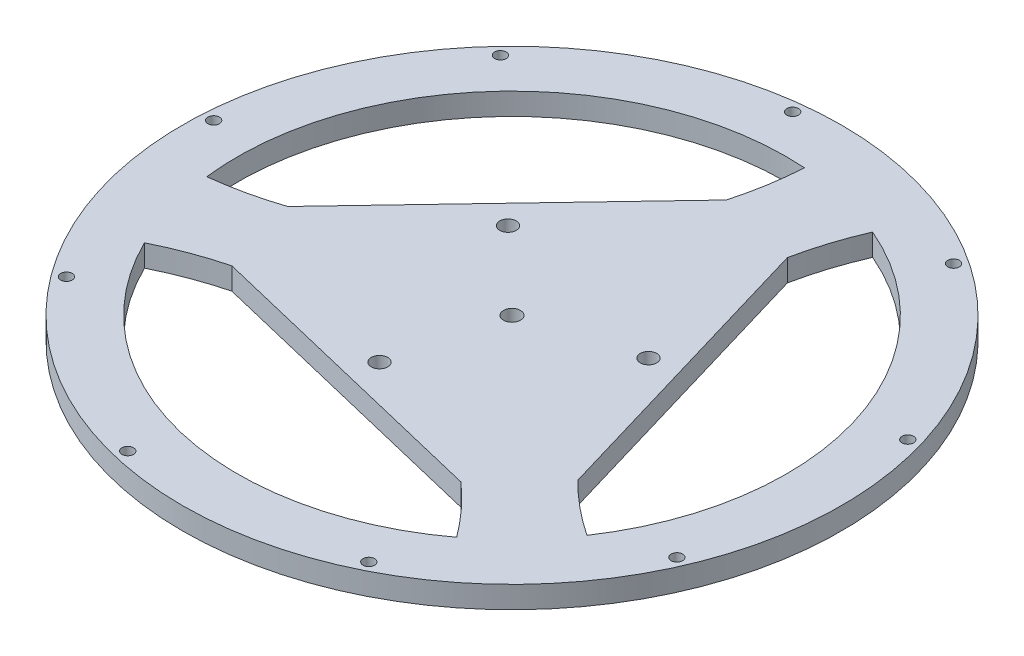
ISO-10303-21;
HEADER;
FILE_DESCRIPTION(('STEP AP214'),'2;1');
FILE_NAME('part.step','',(''),(''),'','','');
FILE_SCHEMA(('AUTOMOTIVE_DESIGN { 1 0 10303 214 1 1 1 1 }'));
ENDSEC;
DATA;
#1=APPLICATION_CONTEXT('core data for automotive mechanical design processes');
#2=APPLICATION_PROTOCOL_DEFINITION('international standard','automotive_design',2000,#1);
#3=PRODUCT_CONTEXT('',#1,'mechanical');
#4=PRODUCT('Part','Part','',(#3));
#5=PRODUCT_RELATED_PRODUCT_CATEGORY('part','',(#4));
#6=PRODUCT_DEFINITION_FORMATION('','',#4);
#7=PRODUCT_DEFINITION_CONTEXT('part definition',#1,'design');
#8=PRODUCT_DEFINITION('design','',#6,#7);
#9=PRODUCT_DEFINITION_SHAPE('','',#8);
#10=(LENGTH_UNIT() NAMED_UNIT(*) SI_UNIT(.MILLI.,.METRE.));
#11=(NAMED_UNIT(*) PLANE_ANGLE_UNIT() SI_UNIT($,.RADIAN.));
#12=(NAMED_UNIT(*) SI_UNIT($,.STERADIAN.) SOLID_ANGLE_UNIT());
#13=UNCERTAINTY_MEASURE_WITH_UNIT(LENGTH_MEASURE(1.E-05),#10,'distance_accuracy_value','');
#14=(GEOMETRIC_REPRESENTATION_CONTEXT(3) GLOBAL_UNCERTAINTY_ASSIGNED_CONTEXT((#13)) GLOBAL_UNIT_ASSIGNED_CONTEXT((#10,
#11,#12)) REPRESENTATION_CONTEXT('',''));
#15=CARTESIAN_POINT('',(0.,0.,0.));
#16=DIRECTION('',(0.,0.,1.));
#17=DIRECTION('',(1.,0.,0.));
#18=AXIS2_PLACEMENT_3D('',#15,#16,#17);
#19=CARTESIAN_POINT('',(0.,4.,0.));
#20=DIRECTION('',(0.,1.,0.));
#21=DIRECTION('',(0.,0.,1.));
#22=AXIS2_PLACEMENT_3D('',#19,#20,#21);
#23=PLANE('',#22);
#24=CARTESIAN_POINT('',(-57.8899742574897,4.,-3.5708375022087));
#25=DIRECTION('',(0.,1.,0.));
#26=DIRECTION('',(0.,0.,1.));
#27=AXIS2_PLACEMENT_3D('',#24,#25,#26);
#28=CIRCLE('',#27,1.05293502772648);
#29=CARTESIAN_POINT('',(-57.8899742574897,4.,-2.51790247448222));
#30=VERTEX_POINT('',#29);
#31=EDGE_CURVE('E470',#30,#30,#28,.F.);
#32=ORIENTED_EDGE('',*,*,#31,.T.);
#33=EDGE_LOOP('',(#32));
#34=FACE_BOUND('',#33,.T.);
#35=CARTESIAN_POINT('',(0.,4.,0.));
#36=DIRECTION('',(0.,1.,0.));
#37=DIRECTION('',(0.,0.,1.));
#38=AXIS2_PLACEMENT_3D('',#35,#36,#37);
#39=CIRCLE('',#38,1.55);
#40=CARTESIAN_POINT('',(0.,4.,1.55));
#41=VERTEX_POINT('',#40);
#42=EDGE_CURVE('E304',#41,#41,#39,.F.);
#43=ORIENTED_EDGE('',*,*,#42,.T.);
#44=EDGE_LOOP('',(#43));
#45=FACE_BOUND('',#44,.T.);
#46=CARTESIAN_POINT('',(53.1774832729495,4.,23.1550269435159));
#47=DIRECTION('',(0.,1.,0.));
#48=DIRECTION('',(0.,0.,1.));
#49=AXIS2_PLACEMENT_3D('',#46,#47,#48);
#50=CIRCLE('',#49,1.05293502772553);
#51=CARTESIAN_POINT('',(53.1774832729495,4.,24.2079619712414));
#52=VERTEX_POINT('',#51);
#53=EDGE_CURVE('E314',#52,#52,#50,.T.);
#54=ORIENTED_EDGE('',*,*,#53,.F.);
#55=EDGE_LOOP('',(#54));
#56=FACE_BOUND('',#55,.T.);
#57=CARTESIAN_POINT('',(-13.5690769919208,4.,56.3904260454485));
#58=DIRECTION('',(0.,1.,0.));
#59=DIRECTION('',(0.,0.,1.));
#60=AXIS2_PLACEMENT_3D('',#57,#58,#59);
#61=CIRCLE('',#60,1.05293502772525);
#62=CARTESIAN_POINT('',(-13.5690769919208,4.,57.4433610731738));
#63=VERTEX_POINT('',#62);
#64=EDGE_CURVE('E326',#63,#63,#61,.T.);
#65=ORIENTED_EDGE('',*,*,#64,.F.);
#66=EDGE_LOOP('',(#65));
#67=FACE_BOUND('',#66,.T.);
#68=CARTESIAN_POINT('',(-6.53590007807735,4.,-57.6305648954562));
#69=DIRECTION('',(0.,1.,0.));
#70=DIRECTION('',(0.,0.,1.));
#71=AXIS2_PLACEMENT_3D('',#68,#69,#70);
#72=CIRCLE('',#71,1.05293502772648);
#73=CARTESIAN_POINT('',(-6.53590007807735,4.,-56.5776298677297));
#74=VERTEX_POINT('',#73);
#75=EDGE_CURVE('E338',#74,#74,#72,.T.);
#76=ORIENTED_EDGE('',*,*,#75,.F.);
#77=EDGE_LOOP('',(#76));
#78=FACE_BOUND('',#77,.T.);
#79=CARTESIAN_POINT('',(55.6200799815454,4.,-16.4440476418153));
#80=DIRECTION('',(0.,1.,0.));
#81=DIRECTION('',(0.,0.,1.));
#82=AXIS2_PLACEMENT_3D('',#79,#80,#81);
#83=CIRCLE('',#82,1.05293502772614);
#84=CARTESIAN_POINT('',(55.6200799815454,4.,-15.3911126140892));
#85=VERTEX_POINT('',#84);
#86=EDGE_CURVE('E350',#85,#85,#83,.T.);
#87=ORIENTED_EDGE('',*,*,#86,.F.);
#88=EDGE_LOOP('',(#87));
#89=FACE_BOUND('',#88,.T.);
#90=CARTESIAN_POINT('',(-4.67899206617935,4.,19.444974498431));
#91=DIRECTION('',(0.,1.,0.));
#92=DIRECTION('',(0.,0.,1.));
#93=AXIS2_PLACEMENT_3D('',#90,#91,#92);
#94=CIRCLE('',#93,1.5);
#95=CARTESIAN_POINT('',(-4.67899206617935,4.,20.944974498431));
#96=VERTEX_POINT('',#95);
#97=EDGE_CURVE('E362',#96,#96,#94,.T.);
#98=ORIENTED_EDGE('',*,*,#97,.F.);
#99=EDGE_LOOP('',(#98));
#100=FACE_BOUND('',#99,.T.);
#101=CARTESIAN_POINT('',(0.,4.,0.));
#102=DIRECTION('',(0.,1.,0.));
#103=DIRECTION('',(0.,0.,1.));
#104=AXIS2_PLACEMENT_3D('',#101,#102,#103);
#105=CIRCLE('',#104,50.);
#106=CARTESIAN_POINT('',(41.5155711519758,4.,27.8649843338415));
#107=VERTEX_POINT('',#106);
#108=CARTESIAN_POINT('',(19.6892098874326,4.,-45.9601459311067));
#109=VERTEX_POINT('',#108);
#110=EDGE_CURVE('E408',#107,#109,#105,.T.);
#111=ORIENTED_EDGE('',*,*,#110,.F.);
#112=CARTESIAN_POINT('',(74.7395128137497,4.,-22.0966979882647));
#113=DIRECTION('',(0.,1.,0.));
#114=DIRECTION('',(0.,0.,1.));
#115=AXIS2_PLACEMENT_3D('',#112,#113,#114);
#116=CIRCLE('',#115,60.);
#117=CARTESIAN_POINT('',(31.9813255757251,4.,19.995313416728));
#118=VERTEX_POINT('',#117);
#119=EDGE_CURVE('E406',#118,#107,#116,.T.);
#120=ORIENTED_EDGE('',*,*,#119,.F.);
#121=DIRECTION('',(-0.28351806278993,0.,-0.958966896233569));
#122=VECTOR('',#121,1.);
#123=CARTESIAN_POINT('',(31.9813255757251,4.,19.995313416728));
#124=LINE('',#123,#122);
#125=CARTESIAN_POINT('',(15.967019235954,4.,-34.1712165562232));
#126=VERTEX_POINT('',#125);
#127=EDGE_CURVE('E414',#118,#126,#124,.T.);
#128=ORIENTED_EDGE('',*,*,#127,.T.);
#129=CARTESIAN_POINT('',(74.7395128137497,4.,-22.0966979882647));
#130=DIRECTION('',(0.,1.,0.));
#131=DIRECTION('',(0.,0.,1.));
#132=AXIS2_PLACEMENT_3D('',#129,#130,#131);
#133=CIRCLE('',#132,60.);
#134=EDGE_CURVE('E411',#109,#126,#133,.T.);
#135=ORIENTED_EDGE('',*,*,#134,.F.);
#136=EDGE_LOOP('',(#111,#120,#128,#135));
#137=FACE_BOUND('',#136,.T.);
#138=CARTESIAN_POINT('',(-14.5003458584922,4.,-13.7746132426325));
#139=DIRECTION('',(0.,1.,0.));
#140=DIRECTION('',(0.,0.,1.));
#141=AXIS2_PLACEMENT_3D('',#138,#139,#140);
#142=CIRCLE('',#141,1.5);
#143=CARTESIAN_POINT('',(-14.5003458584922,4.,-12.2746132426325));
#144=VERTEX_POINT('',#143);
#145=EDGE_CURVE('E438',#144,#144,#142,.T.);
#146=ORIENTED_EDGE('',*,*,#145,.F.);
#147=EDGE_LOOP('',(#146));
#148=FACE_BOUND('',#147,.T.);
#149=CARTESIAN_POINT('',(0.,4.,0.));
#150=DIRECTION('',(0.,1.,0.));
#151=DIRECTION('',(0.,0.,1.));
#152=AXIS2_PLACEMENT_3D('',#149,#150,#151);
#153=CIRCLE('',#152,60.);
#154=CARTESIAN_POINT('',(0.,4.,60.));
#155=VERTEX_POINT('',#154);
#156=EDGE_CURVE('E12',#155,#155,#153,.T.);
#157=ORIENTED_EDGE('',*,*,#156,.T.);
#158=EDGE_LOOP('',(#157));
#159=FACE_BOUND('',#158,.T.);
#160=CARTESIAN_POINT('',(-42.0510029896274,4.,-39.9463784036344));
#161=DIRECTION('',(0.,1.,0.));
#162=DIRECTION('',(0.,0.,1.));
#163=AXIS2_PLACEMENT_3D('',#160,#161,#162);
#164=CIRCLE('',#163,1.05293502772648);
#165=CARTESIAN_POINT('',(-42.0510029896274,4.,-38.8934433759079));
#166=VERTEX_POINT('',#165);
#167=EDGE_CURVE('E400',#166,#166,#164,.T.);
#168=ORIENTED_EDGE('',*,*,#167,.F.);
#169=EDGE_LOOP('',(#168));
#170=FACE_BOUND('',#169,.T.);
#171=CARTESIAN_POINT('',(0.,4.,0.));
#172=DIRECTION('',(0.,1.,0.));
#173=DIRECTION('',(0.,0.,1.));
#174=AXIS2_PLACEMENT_3D('',#171,#172,#173);
#175=CIRCLE('',#174,50.);
#176=CARTESIAN_POINT('',(-44.8895698851501,4.,22.0210471033105));
#177=VERTEX_POINT('',#176);
#178=CARTESIAN_POINT('',(29.9580489942619,4.,40.0314289085139));
#179=VERTEX_POINT('',#178);
#180=EDGE_CURVE('E370',#177,#179,#175,.T.);
#181=ORIENTED_EDGE('',*,*,#180,.F.);
#182=CARTESIAN_POINT('',(-18.2334546092855,4.,75.774665757312));
#183=DIRECTION('',(0.,1.,0.));
#184=DIRECTION('',(0.,0.,1.));
#185=AXIS2_PLACEMENT_3D('',#182,#183,#184);
#186=CIRCLE('',#185,60.);
#187=CARTESIAN_POINT('',(-33.3071121633809,4.,17.6989836869147));
#188=VERTEX_POINT('',#187);
#189=EDGE_CURVE('E368',#188,#177,#186,.T.);
#190=ORIENTED_EDGE('',*,*,#189,.F.);
#191=DIRECTION('',(0.972248724921551,0.,0.233949603308958));
#192=VECTOR('',#191,1.);
#193=CARTESIAN_POINT('',(-33.3071121633809,4.,17.6989836869147));
#194=LINE('',#193,#192);
#195=CARTESIAN_POINT('',(21.6096319979315,4.,30.9134525591627));
#196=VERTEX_POINT('',#195);
#197=EDGE_CURVE('E376',#188,#196,#194,.T.);
#198=ORIENTED_EDGE('',*,*,#197,.T.);
#199=CARTESIAN_POINT('',(-18.2334546092855,4.,75.774665757312));
#200=DIRECTION('',(0.,1.,0.));
#201=DIRECTION('',(0.,0.,1.));
#202=AXIS2_PLACEMENT_3D('',#199,#200,#201);
#203=CIRCLE('',#202,60.);
#204=EDGE_CURVE('E373',#179,#196,#203,.T.);
#205=ORIENTED_EDGE('',*,*,#204,.F.);
#206=EDGE_LOOP('',(#181,#190,#198,#205));
#207=FACE_BOUND('',#206,.T.);
#208=CARTESIAN_POINT('',(19.1793379246714,4.,-5.67036125579842));
#209=DIRECTION('',(0.,1.,0.));
#210=DIRECTION('',(0.,0.,1.));
#211=AXIS2_PLACEMENT_3D('',#208,#209,#210);
#212=CIRCLE('',#211,1.5);
#213=CARTESIAN_POINT('',(19.1793379246714,4.,-4.17036125579842));
#214=VERTEX_POINT('',#213);
#215=EDGE_CURVE('E356',#214,#214,#212,.T.);
#216=ORIENTED_EDGE('',*,*,#215,.F.);
#217=EDGE_LOOP('',(#216));
#218=FACE_BOUND('',#217,.T.);
#219=CARTESIAN_POINT('',(32.037423118442,4.,-48.3487695803088));
#220=DIRECTION('',(0.,1.,0.));
#221=DIRECTION('',(0.,0.,1.));
#222=AXIS2_PLACEMENT_3D('',#219,#220,#221);
#223=CIRCLE('',#222,1.05293502772665);
#224=CARTESIAN_POINT('',(32.037423118442,4.,-47.2958345525821));
#225=VERTEX_POINT('',#224);
#226=EDGE_CURVE('E344',#225,#225,#223,.T.);
#227=ORIENTED_EDGE('',*,*,#226,.F.);
#228=EDGE_LOOP('',(#227));
#229=FACE_BOUND('',#228,.T.);
#230=CARTESIAN_POINT('',(-46.6415831948744,4.,34.4755379519386));
#231=DIRECTION('',(0.,1.,0.));
#232=DIRECTION('',(0.,0.,1.));
#233=AXIS2_PLACEMENT_3D('',#230,#231,#232);
#234=CIRCLE('',#233,1.05293502772574);
#235=CARTESIAN_POINT('',(-46.6415831948744,4.,35.5284729796644));
#236=VERTEX_POINT('',#235);
#237=EDGE_CURVE('E332',#236,#236,#234,.T.);
#238=ORIENTED_EDGE('',*,*,#237,.F.);
#239=EDGE_LOOP('',(#238));
#240=FACE_BOUND('',#239,.T.);
#241=CARTESIAN_POINT('',(25.8525511390449,4.,51.9196070825162));
#242=DIRECTION('',(0.,1.,0.));
#243=DIRECTION('',(0.,0.,1.));
#244=AXIS2_PLACEMENT_3D('',#241,#242,#243);
#245=CIRCLE('',#244,1.05293502772513);
#246=CARTESIAN_POINT('',(25.8525511390449,4.,52.9725421102413));
#247=VERTEX_POINT('',#246);
#248=EDGE_CURVE('E320',#247,#247,#245,.T.);
#249=ORIENTED_EDGE('',*,*,#248,.F.);
#250=EDGE_LOOP('',(#249));
#251=FACE_BOUND('',#250,.T.);
#252=DIRECTION('',(-0.688730662131619,0.,0.725017292924618));
#253=VECTOR('',#252,1.);
#254=CARTESIAN_POINT('',(-18.1254323231156,4.,-17.2182665532906));
#255=LINE('',#254,#253);
#256=CARTESIAN_POINT('',(1.32578658765488,4.,-37.6942971036422));
#257=VERTEX_POINT('',#256);
#258=CARTESIAN_POINT('',(-37.5766512338855,4.,3.25776399706044));
#259=VERTEX_POINT('',#258);
#260=EDGE_CURVE('E288',#257,#259,#255,.T.);
#261=ORIENTED_EDGE('',*,*,#260,.T.);
#262=CARTESIAN_POINT('',(-56.5060582044648,4.,-53.6779677690472));
#263=DIRECTION('',(0.,1.,0.));
#264=DIRECTION('',(0.,0.,1.));
#265=AXIS2_PLACEMENT_3D('',#262,#263,#264);
#266=CIRCLE('',#265,59.9999999999999);
#267=CARTESIAN_POINT('',(-49.6472588816947,4.,5.92871702259306));
#268=VERTEX_POINT('',#267);
#269=EDGE_CURVE('E298',#268,#259,#266,.T.);
#270=ORIENTED_EDGE('',*,*,#269,.F.);
#271=CARTESIAN_POINT('',(0.,4.,0.));
#272=DIRECTION('',(0.,1.,0.));
#273=DIRECTION('',(0.,0.,1.));
#274=AXIS2_PLACEMENT_3D('',#271,#272,#273);
#275=CIRCLE('',#274,50.);
#276=CARTESIAN_POINT('',(3.37399873317395,4.,-49.8860314371522));
#277=VERTEX_POINT('',#276);
#278=EDGE_CURVE('E296',#277,#268,#275,.T.);
#279=ORIENTED_EDGE('',*,*,#278,.F.);
#280=CARTESIAN_POINT('',(-56.5060582044648,4.,-53.6779677690472));
#281=DIRECTION('',(0.,1.,0.));
#282=DIRECTION('',(0.,0.,1.));
#283=AXIS2_PLACEMENT_3D('',#280,#281,#282);
#284=CIRCLE('',#283,60.);
#285=EDGE_CURVE('E280',#257,#277,#284,.T.);
#286=ORIENTED_EDGE('',*,*,#285,.F.);
#287=EDGE_LOOP('',(#261,#270,#279,#286));
#288=FACE_BOUND('',#287,.T.);
#289=ADVANCED_FACE('F187',(#34,#45,#56,#67,#78,#89,#100,#137,#148,#159,#170,#207,#218,#229,#240,
#251,#288),#23,.T.);
#290=CARTESIAN_POINT('',(0.,0.,0.));
#291=DIRECTION('',(0.,1.,0.));
#292=DIRECTION('',(0.,0.,1.));
#293=AXIS2_PLACEMENT_3D('',#290,#291,#292);
#294=PLANE('',#293);
#295=CARTESIAN_POINT('',(-57.8899742574897,0.,-3.5708375022087));
#296=DIRECTION('',(0.,1.,0.));
#297=DIRECTION('',(0.,0.,1.));
#298=AXIS2_PLACEMENT_3D('',#295,#296,#297);
#299=CIRCLE('',#298,1.05293502772648);
#300=CARTESIAN_POINT('',(-57.8899742574897,0.,-2.51790247448222));
#301=VERTEX_POINT('',#300);
#302=EDGE_CURVE('E723',#301,#301,#299,.T.);
#303=ORIENTED_EDGE('',*,*,#302,.T.);
#304=EDGE_LOOP('',(#303));
#305=FACE_BOUND('',#304,.T.);
#306=CARTESIAN_POINT('',(0.,0.,0.));
#307=DIRECTION('',(0.,1.,0.));
#308=DIRECTION('',(0.,0.,1.));
#309=AXIS2_PLACEMENT_3D('',#306,#307,#308);
#310=CIRCLE('',#309,1.55);
#311=CARTESIAN_POINT('',(0.,0.,1.55));
#312=VERTEX_POINT('',#311);
#313=EDGE_CURVE('E725',#312,#312,#310,.T.);
#314=ORIENTED_EDGE('',*,*,#313,.T.);
#315=EDGE_LOOP('',(#314));
#316=FACE_BOUND('',#315,.T.);
#317=CARTESIAN_POINT('',(-42.0510029896274,0.,-39.9463784036344));
#318=DIRECTION('',(0.,1.,0.));
#319=DIRECTION('',(0.,0.,1.));
#320=AXIS2_PLACEMENT_3D('',#317,#318,#319);
#321=CIRCLE('',#320,1.05293502772648);
#322=CARTESIAN_POINT('',(-42.0510029896274,0.,-38.8934433759079));
#323=VERTEX_POINT('',#322);
#324=EDGE_CURVE('E399',#323,#323,#321,.T.);
#325=ORIENTED_EDGE('',*,*,#324,.T.);
#326=EDGE_LOOP('',(#325));
#327=FACE_BOUND('',#326,.T.);
#328=CARTESIAN_POINT('',(74.7395128137497,0.,-22.0966979882647));
#329=DIRECTION('',(0.,1.,0.));
#330=DIRECTION('',(0.,0.,1.));
#331=AXIS2_PLACEMENT_3D('',#328,#329,#330);
#332=CIRCLE('',#331,60.);
#333=CARTESIAN_POINT('',(31.9813255757251,0.,19.995313416728));
#334=VERTEX_POINT('',#333);
#335=CARTESIAN_POINT('',(41.5155711519758,0.,27.8649843338415));
#336=VERTEX_POINT('',#335);
#337=EDGE_CURVE('E403',#334,#336,#332,.T.);
#338=ORIENTED_EDGE('',*,*,#337,.T.);
#339=CARTESIAN_POINT('',(0.,0.,0.));
#340=DIRECTION('',(0.,1.,0.));
#341=DIRECTION('',(0.,0.,1.));
#342=AXIS2_PLACEMENT_3D('',#339,#340,#341);
#343=CIRCLE('',#342,50.);
#344=CARTESIAN_POINT('',(19.6892098874326,0.,-45.9601459311067));
#345=VERTEX_POINT('',#344);
#346=EDGE_CURVE('E420',#336,#345,#343,.T.);
#347=ORIENTED_EDGE('',*,*,#346,.T.);
#348=CARTESIAN_POINT('',(74.7395128137497,0.,-22.0966979882647));
#349=DIRECTION('',(0.,1.,0.));
#350=DIRECTION('',(0.,0.,1.));
#351=AXIS2_PLACEMENT_3D('',#348,#349,#350);
#352=CIRCLE('',#351,60.);
#353=CARTESIAN_POINT('',(15.967019235954,0.,-34.1712165562232));
#354=VERTEX_POINT('',#353);
#355=EDGE_CURVE('E423',#345,#354,#352,.T.);
#356=ORIENTED_EDGE('',*,*,#355,.T.);
#357=DIRECTION('',(-0.28351806278993,0.,-0.958966896233569));
#358=VECTOR('',#357,1.);
#359=CARTESIAN_POINT('',(31.9813255757251,0.,19.995313416728));
#360=LINE('',#359,#358);
#361=EDGE_CURVE('E409',#334,#354,#360,.T.);
#362=ORIENTED_EDGE('',*,*,#361,.F.);
#363=EDGE_LOOP('',(#338,#347,#356,#362));
#364=FACE_BOUND('',#363,.T.);
#365=CARTESIAN_POINT('',(0.,0.,0.));
#366=DIRECTION('',(0.,1.,0.));
#367=DIRECTION('',(0.,0.,1.));
#368=AXIS2_PLACEMENT_3D('',#365,#366,#367);
#369=CIRCLE('',#368,60.);
#370=CARTESIAN_POINT('',(0.,0.,60.));
#371=VERTEX_POINT('',#370);
#372=EDGE_CURVE('E191',#371,#371,#369,.T.);
#373=ORIENTED_EDGE('',*,*,#372,.F.);
#374=EDGE_LOOP('',(#373));
#375=FACE_BOUND('',#374,.T.);
#376=CARTESIAN_POINT('',(-14.5003458584922,0.,-13.7746132426325));
#377=DIRECTION('',(0.,1.,0.));
#378=DIRECTION('',(0.,0.,1.));
#379=AXIS2_PLACEMENT_3D('',#376,#377,#378);
#380=CIRCLE('',#379,1.5);
#381=CARTESIAN_POINT('',(-14.5003458584922,0.,-12.2746132426325));
#382=VERTEX_POINT('',#381);
#383=EDGE_CURVE('E437',#382,#382,#380,.T.);
#384=ORIENTED_EDGE('',*,*,#383,.T.);
#385=EDGE_LOOP('',(#384));
#386=FACE_BOUND('',#385,.T.);
#387=CARTESIAN_POINT('',(-18.2334546092855,0.,75.774665757312));
#388=DIRECTION('',(0.,1.,0.));
#389=DIRECTION('',(0.,0.,1.));
#390=AXIS2_PLACEMENT_3D('',#387,#388,#389);
#391=CIRCLE('',#390,60.);
#392=CARTESIAN_POINT('',(-33.3071121633809,0.,17.6989836869147));
#393=VERTEX_POINT('',#392);
#394=CARTESIAN_POINT('',(-44.8895698851501,0.,22.0210471033105));
#395=VERTEX_POINT('',#394);
#396=EDGE_CURVE('E365',#393,#395,#391,.T.);
#397=ORIENTED_EDGE('',*,*,#396,.T.);
#398=CARTESIAN_POINT('',(0.,0.,0.));
#399=DIRECTION('',(0.,1.,0.));
#400=DIRECTION('',(0.,0.,1.));
#401=AXIS2_PLACEMENT_3D('',#398,#399,#400);
#402=CIRCLE('',#401,50.);
#403=CARTESIAN_POINT('',(29.9580489942619,0.,40.0314289085139));
#404=VERTEX_POINT('',#403);
#405=EDGE_CURVE('E382',#395,#404,#402,.T.);
#406=ORIENTED_EDGE('',*,*,#405,.T.);
#407=CARTESIAN_POINT('',(-18.2334546092855,0.,75.774665757312));
#408=DIRECTION('',(0.,1.,0.));
#409=DIRECTION('',(0.,0.,1.));
#410=AXIS2_PLACEMENT_3D('',#407,#408,#409);
#411=CIRCLE('',#410,60.);
#412=CARTESIAN_POINT('',(21.6096319979315,0.,30.9134525591627));
#413=VERTEX_POINT('',#412);
#414=EDGE_CURVE('E385',#404,#413,#411,.T.);
#415=ORIENTED_EDGE('',*,*,#414,.T.);
#416=DIRECTION('',(0.972248724921551,0.,0.233949603308958));
#417=VECTOR('',#416,1.);
#418=CARTESIAN_POINT('',(-33.3071121633809,0.,17.6989836869147));
#419=LINE('',#418,#417);
#420=EDGE_CURVE('E371',#393,#413,#419,.T.);
#421=ORIENTED_EDGE('',*,*,#420,.F.);
#422=EDGE_LOOP('',(#397,#406,#415,#421));
#423=FACE_BOUND('',#422,.T.);
#424=CARTESIAN_POINT('',(-4.67899206617935,0.,19.444974498431));
#425=DIRECTION('',(0.,1.,0.));
#426=DIRECTION('',(0.,0.,1.));
#427=AXIS2_PLACEMENT_3D('',#424,#425,#426);
#428=CIRCLE('',#427,1.5);
#429=CARTESIAN_POINT('',(-4.67899206617935,0.,20.944974498431));
#430=VERTEX_POINT('',#429);
#431=EDGE_CURVE('E359',#430,#430,#428,.T.);
#432=ORIENTED_EDGE('',*,*,#431,.T.);
#433=EDGE_LOOP('',(#432));
#434=FACE_BOUND('',#433,.T.);
#435=CARTESIAN_POINT('',(19.1793379246714,0.,-5.67036125579842));
#436=DIRECTION('',(0.,1.,0.));
#437=DIRECTION('',(0.,0.,1.));
#438=AXIS2_PLACEMENT_3D('',#435,#436,#437);
#439=CIRCLE('',#438,1.5);
#440=CARTESIAN_POINT('',(19.1793379246714,0.,-4.17036125579842));
#441=VERTEX_POINT('',#440);
#442=EDGE_CURVE('E353',#441,#441,#439,.T.);
#443=ORIENTED_EDGE('',*,*,#442,.T.);
#444=EDGE_LOOP('',(#443));
#445=FACE_BOUND('',#444,.T.);
#446=CARTESIAN_POINT('',(55.6200799815454,0.,-16.4440476418153));
#447=DIRECTION('',(0.,1.,0.));
#448=DIRECTION('',(0.,0.,1.));
#449=AXIS2_PLACEMENT_3D('',#446,#447,#448);
#450=CIRCLE('',#449,1.05293502772614);
#451=CARTESIAN_POINT('',(55.6200799815454,0.,-15.3911126140892));
#452=VERTEX_POINT('',#451);
#453=EDGE_CURVE('E347',#452,#452,#450,.T.);
#454=ORIENTED_EDGE('',*,*,#453,.T.);
#455=EDGE_LOOP('',(#454));
#456=FACE_BOUND('',#455,.T.);
#457=CARTESIAN_POINT('',(32.037423118442,0.,-48.3487695803088));
#458=DIRECTION('',(0.,1.,0.));
#459=DIRECTION('',(0.,0.,1.));
#460=AXIS2_PLACEMENT_3D('',#457,#458,#459);
#461=CIRCLE('',#460,1.05293502772665);
#462=CARTESIAN_POINT('',(32.037423118442,0.,-47.2958345525821));
#463=VERTEX_POINT('',#462);
#464=EDGE_CURVE('E341',#463,#463,#461,.T.);
#465=ORIENTED_EDGE('',*,*,#464,.T.);
#466=EDGE_LOOP('',(#465));
#467=FACE_BOUND('',#466,.T.);
#468=CARTESIAN_POINT('',(-6.53590007807735,0.,-57.6305648954562));
#469=DIRECTION('',(0.,1.,0.));
#470=DIRECTION('',(0.,0.,1.));
#471=AXIS2_PLACEMENT_3D('',#468,#469,#470);
#472=CIRCLE('',#471,1.05293502772648);
#473=CARTESIAN_POINT('',(-6.53590007807735,0.,-56.5776298677297));
#474=VERTEX_POINT('',#473);
#475=EDGE_CURVE('E335',#474,#474,#472,.T.);
#476=ORIENTED_EDGE('',*,*,#475,.T.);
#477=EDGE_LOOP('',(#476));
#478=FACE_BOUND('',#477,.T.);
#479=CARTESIAN_POINT('',(-46.6415831948744,0.,34.4755379519386));
#480=DIRECTION('',(0.,1.,0.));
#481=DIRECTION('',(0.,0.,1.));
#482=AXIS2_PLACEMENT_3D('',#479,#480,#481);
#483=CIRCLE('',#482,1.05293502772574);
#484=CARTESIAN_POINT('',(-46.6415831948744,0.,35.5284729796644));
#485=VERTEX_POINT('',#484);
#486=EDGE_CURVE('E329',#485,#485,#483,.T.);
#487=ORIENTED_EDGE('',*,*,#486,.T.);
#488=EDGE_LOOP('',(#487));
#489=FACE_BOUND('',#488,.T.);
#490=CARTESIAN_POINT('',(-13.5690769919208,0.,56.3904260454485));
#491=DIRECTION('',(0.,1.,0.));
#492=DIRECTION('',(0.,0.,1.));
#493=AXIS2_PLACEMENT_3D('',#490,#491,#492);
#494=CIRCLE('',#493,1.05293502772525);
#495=CARTESIAN_POINT('',(-13.5690769919208,0.,57.4433610731738));
#496=VERTEX_POINT('',#495);
#497=EDGE_CURVE('E323',#496,#496,#494,.T.);
#498=ORIENTED_EDGE('',*,*,#497,.T.);
#499=EDGE_LOOP('',(#498));
#500=FACE_BOUND('',#499,.T.);
#501=CARTESIAN_POINT('',(25.8525511390449,0.,51.9196070825162));
#502=DIRECTION('',(0.,1.,0.));
#503=DIRECTION('',(0.,0.,1.));
#504=AXIS2_PLACEMENT_3D('',#501,#502,#503);
#505=CIRCLE('',#504,1.05293502772513);
#506=CARTESIAN_POINT('',(25.8525511390449,0.,52.9725421102413));
#507=VERTEX_POINT('',#506);
#508=EDGE_CURVE('E317',#507,#507,#505,.T.);
#509=ORIENTED_EDGE('',*,*,#508,.T.);
#510=EDGE_LOOP('',(#509));
#511=FACE_BOUND('',#510,.T.);
#512=CARTESIAN_POINT('',(53.1774832729495,0.,23.1550269435159));
#513=DIRECTION('',(0.,1.,0.));
#514=DIRECTION('',(0.,0.,1.));
#515=AXIS2_PLACEMENT_3D('',#512,#513,#514);
#516=CIRCLE('',#515,1.05293502772553);
#517=CARTESIAN_POINT('',(53.1774832729495,0.,24.2079619712414));
#518=VERTEX_POINT('',#517);
#519=EDGE_CURVE('E284',#518,#518,#516,.T.);
#520=ORIENTED_EDGE('',*,*,#519,.T.);
#521=EDGE_LOOP('',(#520));
#522=FACE_BOUND('',#521,.T.);
#523=CARTESIAN_POINT('',(-56.5060582044648,0.,-53.6779677690472));
#524=DIRECTION('',(0.,1.,0.));
#525=DIRECTION('',(0.,0.,1.));
#526=AXIS2_PLACEMENT_3D('',#523,#524,#525);
#527=CIRCLE('',#526,59.9999999999999);
#528=CARTESIAN_POINT('',(-49.6472588816947,0.,5.92871702259318));
#529=VERTEX_POINT('',#528);
#530=CARTESIAN_POINT('',(-37.5766512338854,0.,3.25776399706055));
#531=VERTEX_POINT('',#530);
#532=EDGE_CURVE('E293',#529,#531,#527,.T.);
#533=ORIENTED_EDGE('',*,*,#532,.T.);
#534=DIRECTION('',(-0.688730662131619,0.,0.725017292924618));
#535=VECTOR('',#534,1.);
#536=CARTESIAN_POINT('',(-18.1254323231156,0.,-17.2182665532906));
#537=LINE('',#536,#535);
#538=CARTESIAN_POINT('',(1.32578658765488,0.,-37.6942971036422));
#539=VERTEX_POINT('',#538);
#540=EDGE_CURVE('E210',#539,#531,#537,.T.);
#541=ORIENTED_EDGE('',*,*,#540,.F.);
#542=CARTESIAN_POINT('',(-56.5060582044648,0.,-53.6779677690472));
#543=DIRECTION('',(0.,1.,0.));
#544=DIRECTION('',(0.,0.,1.));
#545=AXIS2_PLACEMENT_3D('',#542,#543,#544);
#546=CIRCLE('',#545,60.);
#547=CARTESIAN_POINT('',(3.37399873317395,0.,-49.8860314371522));
#548=VERTEX_POINT('',#547);
#549=EDGE_CURVE('E283',#539,#548,#546,.T.);
#550=ORIENTED_EDGE('',*,*,#549,.T.);
#551=CARTESIAN_POINT('',(0.,0.,0.));
#552=DIRECTION('',(0.,1.,0.));
#553=DIRECTION('',(0.,0.,1.));
#554=AXIS2_PLACEMENT_3D('',#551,#552,#553);
#555=CIRCLE('',#554,50.);
#556=EDGE_CURVE('E306',#548,#529,#555,.T.);
#557=ORIENTED_EDGE('',*,*,#556,.T.);
#558=EDGE_LOOP('',(#533,#541,#550,#557));
#559=FACE_BOUND('',#558,.T.);
#560=ADVANCED_FACE('F444',(#305,#316,#327,#364,#375,#386,#423,#434,#445,#456,#467,#478,#489,
#500,#511,#522,#559),#294,.F.);
#561=CARTESIAN_POINT('',(0.,4.,0.));
#562=DIRECTION('',(0.,-1.,0.));
#563=DIRECTION('',(0.,0.,-1.));
#564=AXIS2_PLACEMENT_3D('',#561,#562,#563);
#565=CYLINDRICAL_SURFACE('',#564,60.);
#566=ORIENTED_EDGE('',*,*,#156,.F.);
#567=EDGE_LOOP('',(#566));
#568=FACE_BOUND('',#567,.T.);
#569=ORIENTED_EDGE('',*,*,#372,.T.);
#570=EDGE_LOOP('',(#569));
#571=FACE_BOUND('',#570,.T.);
#572=ADVANCED_FACE('F189',(#568,#571),#565,.T.);
#573=CARTESIAN_POINT('',(-14.5003458584922,4.,-13.7746132426325));
#574=DIRECTION('',(0.,-1.,0.));
#575=DIRECTION('',(0.,0.,-1.));
#576=AXIS2_PLACEMENT_3D('',#573,#574,#575);
#577=CYLINDRICAL_SURFACE('',#576,1.5);
#578=ORIENTED_EDGE('',*,*,#145,.T.);
#579=EDGE_LOOP('',(#578));
#580=FACE_BOUND('',#579,.T.);
#581=ORIENTED_EDGE('',*,*,#383,.F.);
#582=EDGE_LOOP('',(#581));
#583=FACE_BOUND('',#582,.T.);
#584=ADVANCED_FACE('F447',(#580,#583),#577,.F.);
#585=CARTESIAN_POINT('',(74.7395128137497,4.,-22.0966979882647));
#586=DIRECTION('',(0.,-1.,0.));
#587=DIRECTION('',(0.,0.,-1.));
#588=AXIS2_PLACEMENT_3D('',#585,#586,#587);
#589=CYLINDRICAL_SURFACE('',#588,60.);
#590=ORIENTED_EDGE('',*,*,#337,.F.);
#591=DIRECTION('',(0.,-1.,0.));
#592=VECTOR('',#591,1.);
#593=CARTESIAN_POINT('',(31.9813255757251,4.,19.995313416728));
#594=LINE('',#593,#592);
#595=EDGE_CURVE('E417',#118,#334,#594,.T.);
#596=ORIENTED_EDGE('',*,*,#595,.F.);
#597=ORIENTED_EDGE('',*,*,#119,.T.);
#598=DIRECTION('',(0.,-1.,0.));
#599=VECTOR('',#598,1.);
#600=CARTESIAN_POINT('',(41.5155711519758,4.,27.8649843338415));
#601=LINE('',#600,#599);
#602=EDGE_CURVE('E434',#107,#336,#601,.T.);
#603=ORIENTED_EDGE('',*,*,#602,.T.);
#604=EDGE_LOOP('',(#590,#596,#597,#603));
#605=FACE_BOUND('',#604,.T.);
#606=ADVANCED_FACE('F449',(#605),#589,.F.);
#607=CARTESIAN_POINT('',(0.,4.,0.));
#608=DIRECTION('',(0.,-1.,0.));
#609=DIRECTION('',(0.,0.,-1.));
#610=AXIS2_PLACEMENT_3D('',#607,#608,#609);
#611=CYLINDRICAL_SURFACE('',#610,50.);
#612=ORIENTED_EDGE('',*,*,#346,.F.);
#613=ORIENTED_EDGE('',*,*,#602,.F.);
#614=ORIENTED_EDGE('',*,*,#110,.T.);
#615=DIRECTION('',(0.,-1.,0.));
#616=VECTOR('',#615,1.);
#617=CARTESIAN_POINT('',(19.6892098874326,4.,-45.9601459311067));
#618=LINE('',#617,#616);
#619=EDGE_CURVE('E432',#109,#345,#618,.T.);
#620=ORIENTED_EDGE('',*,*,#619,.T.);
#621=EDGE_LOOP('',(#612,#613,#614,#620));
#622=FACE_BOUND('',#621,.T.);
#623=ADVANCED_FACE('F456',(#622),#611,.F.);
#624=CARTESIAN_POINT('',(74.7395128137497,4.,-22.0966979882647));
#625=DIRECTION('',(0.,-1.,0.));
#626=DIRECTION('',(0.,0.,-1.));
#627=AXIS2_PLACEMENT_3D('',#624,#625,#626);
#628=CYLINDRICAL_SURFACE('',#627,60.);
#629=ORIENTED_EDGE('',*,*,#355,.F.);
#630=ORIENTED_EDGE('',*,*,#619,.F.);
#631=ORIENTED_EDGE('',*,*,#134,.T.);
#632=DIRECTION('',(0.,-1.,0.));
#633=VECTOR('',#632,1.);
#634=CARTESIAN_POINT('',(15.967019235954,4.,-34.1712165562232));
#635=LINE('',#634,#633);
#636=EDGE_CURVE('E430',#126,#354,#635,.T.);
#637=ORIENTED_EDGE('',*,*,#636,.T.);
#638=EDGE_LOOP('',(#629,#630,#631,#637));
#639=FACE_BOUND('',#638,.T.);
#640=ADVANCED_FACE('F591',(#639),#628,.F.);
#641=CARTESIAN_POINT('',(31.9813255757251,4.,19.995313416728));
#642=DIRECTION('',(-0.958966896233569,0.,0.28351806278993));
#643=DIRECTION('',(0.28351806278993,0.,0.958966896233569));
#644=AXIS2_PLACEMENT_3D('',#641,#642,#643);
#645=PLANE('',#644);
#646=ORIENTED_EDGE('',*,*,#361,.T.);
#647=ORIENTED_EDGE('',*,*,#636,.F.);
#648=ORIENTED_EDGE('',*,*,#127,.F.);
#649=ORIENTED_EDGE('',*,*,#595,.T.);
#650=EDGE_LOOP('',(#646,#647,#648,#649));
#651=FACE_BOUND('',#650,.T.);
#652=ADVANCED_FACE('F587',(#651),#645,.F.);
#653=CARTESIAN_POINT('',(-42.0510029896274,4.,-39.9463784036344));
#654=DIRECTION('',(0.,-1.,0.));
#655=DIRECTION('',(0.,0.,-1.));
#656=AXIS2_PLACEMENT_3D('',#653,#654,#655);
#657=CYLINDRICAL_SURFACE('',#656,1.05293502772648);
#658=ORIENTED_EDGE('',*,*,#167,.T.);
#659=EDGE_LOOP('',(#658));
#660=FACE_BOUND('',#659,.T.);
#661=ORIENTED_EDGE('',*,*,#324,.F.);
#662=EDGE_LOOP('',(#661));
#663=FACE_BOUND('',#662,.T.);
#664=ADVANCED_FACE('F583',(#660,#663),#657,.F.);
#665=CARTESIAN_POINT('',(-18.2334546092855,4.,75.774665757312));
#666=DIRECTION('',(0.,-1.,0.));
#667=DIRECTION('',(0.,0.,-1.));
#668=AXIS2_PLACEMENT_3D('',#665,#666,#667);
#669=CYLINDRICAL_SURFACE('',#668,60.);
#670=ORIENTED_EDGE('',*,*,#396,.F.);
#671=DIRECTION('',(0.,-1.,0.));
#672=VECTOR('',#671,1.);
#673=CARTESIAN_POINT('',(-33.3071121633809,4.,17.6989836869147));
#674=LINE('',#673,#672);
#675=EDGE_CURVE('E379',#188,#393,#674,.T.);
#676=ORIENTED_EDGE('',*,*,#675,.F.);
#677=ORIENTED_EDGE('',*,*,#189,.T.);
#678=DIRECTION('',(0.,-1.,0.));
#679=VECTOR('',#678,1.);
#680=CARTESIAN_POINT('',(-44.8895698851501,4.,22.0210471033105));
#681=LINE('',#680,#679);
#682=EDGE_CURVE('E396',#177,#395,#681,.T.);
#683=ORIENTED_EDGE('',*,*,#682,.T.);
#684=EDGE_LOOP('',(#670,#676,#677,#683));
#685=FACE_BOUND('',#684,.T.);
#686=ADVANCED_FACE('F579',(#685),#669,.F.);
#687=CARTESIAN_POINT('',(0.,4.,0.));
#688=DIRECTION('',(0.,-1.,0.));
#689=DIRECTION('',(0.,0.,-1.));
#690=AXIS2_PLACEMENT_3D('',#687,#688,#689);
#691=CYLINDRICAL_SURFACE('',#690,50.);
#692=ORIENTED_EDGE('',*,*,#405,.F.);
#693=ORIENTED_EDGE('',*,*,#682,.F.);
#694=ORIENTED_EDGE('',*,*,#180,.T.);
#695=DIRECTION('',(0.,-1.,0.));
#696=VECTOR('',#695,1.);
#697=CARTESIAN_POINT('',(29.9580489942619,4.,40.0314289085139));
#698=LINE('',#697,#696);
#699=EDGE_CURVE('E394',#179,#404,#698,.T.);
#700=ORIENTED_EDGE('',*,*,#699,.T.);
#701=EDGE_LOOP('',(#692,#693,#694,#700));
#702=FACE_BOUND('',#701,.T.);
#703=ADVANCED_FACE('F575',(#702),#691,.F.);
#704=CARTESIAN_POINT('',(-18.2334546092855,4.,75.774665757312));
#705=DIRECTION('',(0.,-1.,0.));
#706=DIRECTION('',(0.,0.,-1.));
#707=AXIS2_PLACEMENT_3D('',#704,#705,#706);
#708=CYLINDRICAL_SURFACE('',#707,60.);
#709=ORIENTED_EDGE('',*,*,#414,.F.);
#710=ORIENTED_EDGE('',*,*,#699,.F.);
#711=ORIENTED_EDGE('',*,*,#204,.T.);
#712=DIRECTION('',(0.,-1.,0.));
#713=VECTOR('',#712,1.);
#714=CARTESIAN_POINT('',(21.6096319979315,4.,30.9134525591627));
#715=LINE('',#714,#713);
#716=EDGE_CURVE('E392',#196,#413,#715,.T.);
#717=ORIENTED_EDGE('',*,*,#716,.T.);
#718=EDGE_LOOP('',(#709,#710,#711,#717));
#719=FACE_BOUND('',#718,.T.);
#720=ADVANCED_FACE('F571',(#719),#708,.F.);
#721=CARTESIAN_POINT('',(-33.3071121633809,4.,17.6989836869147));
#722=DIRECTION('',(0.233949603308958,0.,-0.972248724921551));
#723=DIRECTION('',(-0.972248724921551,0.,-0.233949603308958));
#724=AXIS2_PLACEMENT_3D('',#721,#722,#723);
#725=PLANE('',#724);
#726=ORIENTED_EDGE('',*,*,#420,.T.);
#727=ORIENTED_EDGE('',*,*,#716,.F.);
#728=ORIENTED_EDGE('',*,*,#197,.F.);
#729=ORIENTED_EDGE('',*,*,#675,.T.);
#730=EDGE_LOOP('',(#726,#727,#728,#729));
#731=FACE_BOUND('',#730,.T.);
#732=ADVANCED_FACE('F567',(#731),#725,.F.);
#733=CARTESIAN_POINT('',(-4.67899206617935,4.,19.444974498431));
#734=DIRECTION('',(0.,-1.,0.));
#735=DIRECTION('',(0.,0.,-1.));
#736=AXIS2_PLACEMENT_3D('',#733,#734,#735);
#737=CYLINDRICAL_SURFACE('',#736,1.5);
#738=ORIENTED_EDGE('',*,*,#97,.T.);
#739=EDGE_LOOP('',(#738));
#740=FACE_BOUND('',#739,.T.);
#741=ORIENTED_EDGE('',*,*,#431,.F.);
#742=EDGE_LOOP('',(#741));
#743=FACE_BOUND('',#742,.T.);
#744=ADVANCED_FACE('F563',(#740,#743),#737,.F.);
#745=CARTESIAN_POINT('',(19.1793379246714,4.,-5.67036125579842));
#746=DIRECTION('',(0.,-1.,0.));
#747=DIRECTION('',(0.,0.,-1.));
#748=AXIS2_PLACEMENT_3D('',#745,#746,#747);
#749=CYLINDRICAL_SURFACE('',#748,1.5);
#750=ORIENTED_EDGE('',*,*,#215,.T.);
#751=EDGE_LOOP('',(#750));
#752=FACE_BOUND('',#751,.T.);
#753=ORIENTED_EDGE('',*,*,#442,.F.);
#754=EDGE_LOOP('',(#753));
#755=FACE_BOUND('',#754,.T.);
#756=ADVANCED_FACE('F559',(#752,#755),#749,.F.);
#757=CARTESIAN_POINT('',(55.6200799815454,4.,-16.4440476418153));
#758=DIRECTION('',(0.,-1.,0.));
#759=DIRECTION('',(0.,0.,-1.));
#760=AXIS2_PLACEMENT_3D('',#757,#758,#759);
#761=CYLINDRICAL_SURFACE('',#760,1.05293502772614);
#762=ORIENTED_EDGE('',*,*,#86,.T.);
#763=EDGE_LOOP('',(#762));
#764=FACE_BOUND('',#763,.T.);
#765=ORIENTED_EDGE('',*,*,#453,.F.);
#766=EDGE_LOOP('',(#765));
#767=FACE_BOUND('',#766,.T.);
#768=ADVANCED_FACE('F555',(#764,#767),#761,.F.);
#769=CARTESIAN_POINT('',(32.037423118442,4.,-48.3487695803088));
#770=DIRECTION('',(0.,-1.,0.));
#771=DIRECTION('',(0.,0.,-1.));
#772=AXIS2_PLACEMENT_3D('',#769,#770,#771);
#773=CYLINDRICAL_SURFACE('',#772,1.05293502772665);
#774=ORIENTED_EDGE('',*,*,#226,.T.);
#775=EDGE_LOOP('',(#774));
#776=FACE_BOUND('',#775,.T.);
#777=ORIENTED_EDGE('',*,*,#464,.F.);
#778=EDGE_LOOP('',(#777));
#779=FACE_BOUND('',#778,.T.);
#780=ADVANCED_FACE('F551',(#776,#779),#773,.F.);
#781=CARTESIAN_POINT('',(-6.53590007807735,4.,-57.6305648954562));
#782=DIRECTION('',(0.,-1.,0.));
#783=DIRECTION('',(0.,0.,-1.));
#784=AXIS2_PLACEMENT_3D('',#781,#782,#783);
#785=CYLINDRICAL_SURFACE('',#784,1.05293502772648);
#786=ORIENTED_EDGE('',*,*,#75,.T.);
#787=EDGE_LOOP('',(#786));
#788=FACE_BOUND('',#787,.T.);
#789=ORIENTED_EDGE('',*,*,#475,.F.);
#790=EDGE_LOOP('',(#789));
#791=FACE_BOUND('',#790,.T.);
#792=ADVANCED_FACE('F547',(#788,#791),#785,.F.);
#793=CARTESIAN_POINT('',(-46.6415831948744,4.,34.4755379519386));
#794=DIRECTION('',(0.,-1.,0.));
#795=DIRECTION('',(0.,0.,-1.));
#796=AXIS2_PLACEMENT_3D('',#793,#794,#795);
#797=CYLINDRICAL_SURFACE('',#796,1.05293502772574);
#798=ORIENTED_EDGE('',*,*,#237,.T.);
#799=EDGE_LOOP('',(#798));
#800=FACE_BOUND('',#799,.T.);
#801=ORIENTED_EDGE('',*,*,#486,.F.);
#802=EDGE_LOOP('',(#801));
#803=FACE_BOUND('',#802,.T.);
#804=ADVANCED_FACE('F543',(#800,#803),#797,.F.);
#805=CARTESIAN_POINT('',(-13.5690769919208,4.,56.3904260454485));
#806=DIRECTION('',(0.,-1.,0.));
#807=DIRECTION('',(0.,0.,-1.));
#808=AXIS2_PLACEMENT_3D('',#805,#806,#807);
#809=CYLINDRICAL_SURFACE('',#808,1.05293502772525);
#810=ORIENTED_EDGE('',*,*,#64,.T.);
#811=EDGE_LOOP('',(#810));
#812=FACE_BOUND('',#811,.T.);
#813=ORIENTED_EDGE('',*,*,#497,.F.);
#814=EDGE_LOOP('',(#813));
#815=FACE_BOUND('',#814,.T.);
#816=ADVANCED_FACE('F510',(#812,#815),#809,.F.);
#817=CARTESIAN_POINT('',(25.8525511390449,4.,51.9196070825162));
#818=DIRECTION('',(0.,-1.,0.));
#819=DIRECTION('',(0.,0.,-1.));
#820=AXIS2_PLACEMENT_3D('',#817,#818,#819);
#821=CYLINDRICAL_SURFACE('',#820,1.05293502772513);
#822=ORIENTED_EDGE('',*,*,#248,.T.);
#823=EDGE_LOOP('',(#822));
#824=FACE_BOUND('',#823,.T.);
#825=ORIENTED_EDGE('',*,*,#508,.F.);
#826=EDGE_LOOP('',(#825));
#827=FACE_BOUND('',#826,.T.);
#828=ADVANCED_FACE('F506',(#824,#827),#821,.F.);
#829=CARTESIAN_POINT('',(53.1774832729495,4.,23.1550269435159));
#830=DIRECTION('',(0.,-1.,0.));
#831=DIRECTION('',(0.,0.,-1.));
#832=AXIS2_PLACEMENT_3D('',#829,#830,#831);
#833=CYLINDRICAL_SURFACE('',#832,1.05293502772553);
#834=ORIENTED_EDGE('',*,*,#53,.T.);
#835=EDGE_LOOP('',(#834));
#836=FACE_BOUND('',#835,.T.);
#837=ORIENTED_EDGE('',*,*,#519,.F.);
#838=EDGE_LOOP('',(#837));
#839=FACE_BOUND('',#838,.T.);
#840=ADVANCED_FACE('F509',(#836,#839),#833,.F.);
#841=CARTESIAN_POINT('',(-18.1254323231156,4.,-17.2182665532906));
#842=DIRECTION('',(0.725017292924618,0.,0.688730662131619));
#843=DIRECTION('',(0.688730662131619,0.,-0.725017292924618));
#844=AXIS2_PLACEMENT_3D('',#841,#842,#843);
#845=PLANE('',#844);
#846=ORIENTED_EDGE('',*,*,#540,.T.);
#847=DIRECTION('',(0.,-1.,0.));
#848=VECTOR('',#847,1.);
#849=CARTESIAN_POINT('',(-37.5766512338855,4.,3.25776399706044));
#850=LINE('',#849,#848);
#851=EDGE_CURVE('E290',#259,#531,#850,.T.);
#852=ORIENTED_EDGE('',*,*,#851,.F.);
#853=ORIENTED_EDGE('',*,*,#260,.F.);
#854=DIRECTION('',(0.,-1.,0.));
#855=VECTOR('',#854,1.);
#856=CARTESIAN_POINT('',(1.32578658765488,4.,-37.6942971036422));
#857=LINE('',#856,#855);
#858=EDGE_CURVE('E276',#257,#539,#857,.T.);
#859=ORIENTED_EDGE('',*,*,#858,.T.);
#860=EDGE_LOOP('',(#846,#852,#853,#859));
#861=FACE_BOUND('',#860,.T.);
#862=ADVANCED_FACE('F289',(#861),#845,.F.);
#863=CARTESIAN_POINT('',(-56.5060582044648,4.,-53.6779677690472));
#864=DIRECTION('',(0.,-1.,0.));
#865=DIRECTION('',(0.,0.,-1.));
#866=AXIS2_PLACEMENT_3D('',#863,#864,#865);
#867=CYLINDRICAL_SURFACE('',#866,60.);
#868=ORIENTED_EDGE('',*,*,#549,.F.);
#869=ORIENTED_EDGE('',*,*,#858,.F.);
#870=ORIENTED_EDGE('',*,*,#285,.T.);
#871=DIRECTION('',(0.,-1.,0.));
#872=VECTOR('',#871,1.);
#873=CARTESIAN_POINT('',(3.37399873317395,4.,-49.8860314371522));
#874=LINE('',#873,#872);
#875=EDGE_CURVE('E285',#277,#548,#874,.T.);
#876=ORIENTED_EDGE('',*,*,#875,.T.);
#877=EDGE_LOOP('',(#868,#869,#870,#876));
#878=FACE_BOUND('',#877,.T.);
#879=ADVANCED_FACE('F278',(#878),#867,.F.);
#880=CARTESIAN_POINT('',(0.,4.,0.));
#881=DIRECTION('',(0.,-1.,0.));
#882=DIRECTION('',(0.,0.,-1.));
#883=AXIS2_PLACEMENT_3D('',#880,#881,#882);
#884=CYLINDRICAL_SURFACE('',#883,50.);
#885=ORIENTED_EDGE('',*,*,#556,.F.);
#886=ORIENTED_EDGE('',*,*,#875,.F.);
#887=ORIENTED_EDGE('',*,*,#278,.T.);
#888=DIRECTION('',(0.,-1.,0.));
#889=VECTOR('',#888,1.);
#890=CARTESIAN_POINT('',(-49.6472588816947,4.,5.92871702259318));
#891=LINE('',#890,#889);
#892=EDGE_CURVE('E202',#268,#529,#891,.T.);
#893=ORIENTED_EDGE('',*,*,#892,.T.);
#894=EDGE_LOOP('',(#885,#886,#887,#893));
#895=FACE_BOUND('',#894,.T.);
#896=ADVANCED_FACE('F521',(#895),#884,.F.);
#897=CARTESIAN_POINT('',(-56.5060582044648,4.,-53.6779677690472));
#898=DIRECTION('',(0.,-1.,0.));
#899=DIRECTION('',(0.,0.,-1.));
#900=AXIS2_PLACEMENT_3D('',#897,#898,#899);
#901=CYLINDRICAL_SURFACE('',#900,59.9999999999999);
#902=ORIENTED_EDGE('',*,*,#532,.F.);
#903=ORIENTED_EDGE('',*,*,#892,.F.);
#904=ORIENTED_EDGE('',*,*,#269,.T.);
#905=ORIENTED_EDGE('',*,*,#851,.T.);
#906=EDGE_LOOP('',(#902,#903,#904,#905));
#907=FACE_BOUND('',#906,.T.);
#908=ADVANCED_FACE('F518',(#907),#901,.F.);
#909=CARTESIAN_POINT('',(0.,10.,0.));
#910=DIRECTION('',(0.,-1.,0.));
#911=DIRECTION('',(0.,0.,-1.));
#912=AXIS2_PLACEMENT_3D('',#909,#910,#911);
#913=CYLINDRICAL_SURFACE('',#912,1.55);
#914=ORIENTED_EDGE('',*,*,#42,.F.);
#915=EDGE_LOOP('',(#914));
#916=FACE_BOUND('',#915,.T.);
#917=ORIENTED_EDGE('',*,*,#313,.F.);
#918=EDGE_LOOP('',(#917));
#919=FACE_BOUND('',#918,.T.);
#920=ADVANCED_FACE('F520',(#916,#919),#913,.F.);
#921=CARTESIAN_POINT('',(-57.8899742574897,10.,-3.5708375022087));
#922=DIRECTION('',(0.,-1.,0.));
#923=DIRECTION('',(0.,0.,-1.));
#924=AXIS2_PLACEMENT_3D('',#921,#922,#923);
#925=CYLINDRICAL_SURFACE('',#924,1.05293502772648);
#926=ORIENTED_EDGE('',*,*,#31,.F.);
#927=EDGE_LOOP('',(#926));
#928=FACE_BOUND('',#927,.T.);
#929=ORIENTED_EDGE('',*,*,#302,.F.);
#930=EDGE_LOOP('',(#929));
#931=FACE_BOUND('',#930,.T.);
#932=ADVANCED_FACE('F527',(#928,#931),#925,.F.);
#933=CLOSED_SHELL('',(#289,#560,#572,#584,#606,#623,#640,#652,#664,#686,#703,#720,#732,#744,
#756,#768,#780,#792,#804,#816,#828,#840,#862,#879,#896,#908,#920,#932));
#934=MANIFOLD_SOLID_BREP('B2',#933);
#935=ADVANCED_BREP_SHAPE_REPRESENTATION('',(#18,#934),#14);
#936=SHAPE_DEFINITION_REPRESENTATION(#9,#935);
ENDSEC;
END-ISO-10303-21;
